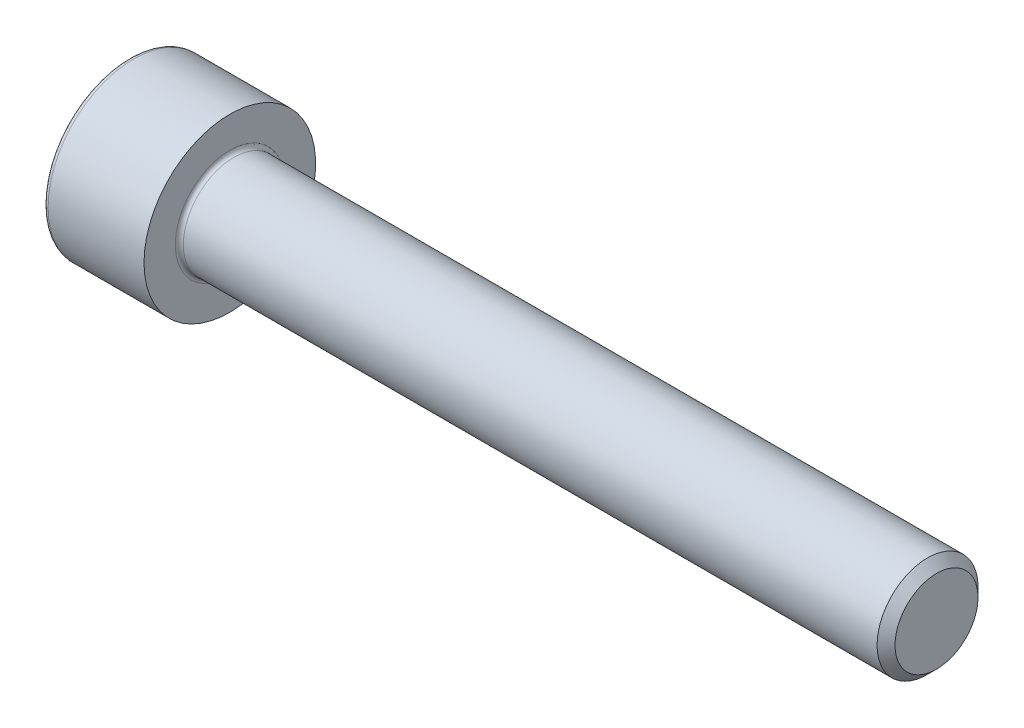
ISO-10303-21;
HEADER;
FILE_DESCRIPTION(('STEP AP214'),'2;1');
FILE_NAME('part.step','',(''),(''),'','','');
FILE_SCHEMA(('AUTOMOTIVE_DESIGN { 1 0 10303 214 1 1 1 1 }'));
ENDSEC;
DATA;
#1=APPLICATION_CONTEXT('core data for automotive mechanical design processes');
#2=APPLICATION_PROTOCOL_DEFINITION('international standard','automotive_design',2000,#1);
#3=PRODUCT_CONTEXT('',#1,'mechanical');
#4=PRODUCT('Part','Part','',(#3));
#5=PRODUCT_RELATED_PRODUCT_CATEGORY('part','',(#4));
#6=PRODUCT_DEFINITION_FORMATION('','',#4);
#7=PRODUCT_DEFINITION_CONTEXT('part definition',#1,'design');
#8=PRODUCT_DEFINITION('design','',#6,#7);
#9=PRODUCT_DEFINITION_SHAPE('','',#8);
#10=(LENGTH_UNIT() NAMED_UNIT(*) SI_UNIT(.MILLI.,.METRE.));
#11=(NAMED_UNIT(*) PLANE_ANGLE_UNIT() SI_UNIT($,.RADIAN.));
#12=(NAMED_UNIT(*) SI_UNIT($,.STERADIAN.) SOLID_ANGLE_UNIT());
#13=UNCERTAINTY_MEASURE_WITH_UNIT(LENGTH_MEASURE(1.E-05),#10,'distance_accuracy_value','');
#14=(GEOMETRIC_REPRESENTATION_CONTEXT(3) GLOBAL_UNCERTAINTY_ASSIGNED_CONTEXT((#13)) GLOBAL_UNIT_ASSIGNED_CONTEXT((#10,
#11,#12)) REPRESENTATION_CONTEXT('',''));
#15=CARTESIAN_POINT('',(0.,0.,0.));
#16=DIRECTION('',(0.,0.,1.));
#17=DIRECTION('',(1.,0.,0.));
#18=AXIS2_PLACEMENT_3D('',#15,#16,#17);
#19=CARTESIAN_POINT('',(0.,0.,0.));
#20=DIRECTION('',(-1.,0.,0.));
#21=DIRECTION('',(0.,0.,1.));
#22=AXIS2_PLACEMENT_3D('',#19,#20,#21);
#23=PLANE('',#22);
#24=DIRECTION('',(0.,-0.5,0.866025403784439));
#25=VECTOR('',#24,1.);
#26=CARTESIAN_POINT('',(0.,2.35789849937043,0.));
#27=LINE('',#26,#25);
#28=CARTESIAN_POINT('',(0.,2.35789849937043,0.));
#29=VERTEX_POINT('',#28);
#30=CARTESIAN_POINT('',(0.,1.17894924968521,2.042));
#31=VERTEX_POINT('',#30);
#32=EDGE_CURVE('E285',#29,#31,#27,.T.);
#33=ORIENTED_EDGE('',*,*,#32,.T.);
#34=DIRECTION('',(0.,1.,0.));
#35=VECTOR('',#34,1.);
#36=CARTESIAN_POINT('',(0.,-1.17894924968522,2.042));
#37=LINE('',#36,#35);
#38=CARTESIAN_POINT('',(0.,-1.17894924968522,2.042));
#39=VERTEX_POINT('',#38);
#40=EDGE_CURVE('E142',#39,#31,#37,.T.);
#41=ORIENTED_EDGE('',*,*,#40,.F.);
#42=DIRECTION('',(0.,-0.500000000000001,-0.866025403784438));
#43=VECTOR('',#42,1.);
#44=CARTESIAN_POINT('',(0.,-1.17894924968522,2.042));
#45=LINE('',#44,#43);
#46=CARTESIAN_POINT('',(0.,-2.35789849937044,0.));
#47=VERTEX_POINT('',#46);
#48=EDGE_CURVE('E290',#39,#47,#45,.T.);
#49=ORIENTED_EDGE('',*,*,#48,.T.);
#50=DIRECTION('',(0.,0.499999999999999,-0.866025403784439));
#51=VECTOR('',#50,1.);
#52=CARTESIAN_POINT('',(0.,-2.35789849937044,0.));
#53=LINE('',#52,#51);
#54=CARTESIAN_POINT('',(0.,-1.17894924968522,-2.042));
#55=VERTEX_POINT('',#54);
#56=EDGE_CURVE('E294',#47,#55,#53,.T.);
#57=ORIENTED_EDGE('',*,*,#56,.T.);
#58=DIRECTION('',(0.,-1.,0.));
#59=VECTOR('',#58,1.);
#60=CARTESIAN_POINT('',(0.,1.17894924968521,-2.042));
#61=LINE('',#60,#59);
#62=CARTESIAN_POINT('',(0.,1.17894924968521,-2.042));
#63=VERTEX_POINT('',#62);
#64=EDGE_CURVE('E298',#63,#55,#61,.T.);
#65=ORIENTED_EDGE('',*,*,#64,.F.);
#66=DIRECTION('',(0.,-0.500000000000001,-0.866025403784438));
#67=VECTOR('',#66,1.);
#68=CARTESIAN_POINT('',(0.,2.35789849937043,0.));
#69=LINE('',#68,#67);
#70=EDGE_CURVE('E137',#29,#63,#69,.T.);
#71=ORIENTED_EDGE('',*,*,#70,.F.);
#72=EDGE_LOOP('',(#33,#41,#49,#57,#65,#71));
#73=FACE_BOUND('',#72,.T.);
#74=CARTESIAN_POINT('',(0.,0.,0.));
#75=DIRECTION('',(-1.,0.,0.));
#76=DIRECTION('',(0.,0.,1.));
#77=AXIS2_PLACEMENT_3D('',#74,#75,#76);
#78=CIRCLE('',#77,4.);
#79=CARTESIAN_POINT('',(0.,0.,4.));
#80=VERTEX_POINT('',#79);
#81=EDGE_CURVE('E52',#80,#80,#78,.T.);
#82=ORIENTED_EDGE('',*,*,#81,.T.);
#83=EDGE_LOOP('',(#82));
#84=FACE_BOUND('',#83,.T.);
#85=ADVANCED_FACE('F43',(#73,#84),#23,.T.);
#86=CARTESIAN_POINT('',(-31.75,0.,0.));
#87=DIRECTION('',(-1.,0.,0.));
#88=DIRECTION('',(0.,0.,1.));
#89=AXIS2_PLACEMENT_3D('',#86,#87,#88);
#90=CYLINDRICAL_SURFACE('',#89,4.25);
#91=CARTESIAN_POINT('',(0.25,0.,0.));
#92=DIRECTION('',(-1.,0.,0.));
#93=DIRECTION('',(0.,0.,1.));
#94=AXIS2_PLACEMENT_3D('',#91,#92,#93);
#95=CIRCLE('',#94,4.25);
#96=CARTESIAN_POINT('',(0.25,0.,4.25));
#97=VERTEX_POINT('',#96);
#98=EDGE_CURVE('E11',#97,#97,#95,.F.);
#99=ORIENTED_EDGE('',*,*,#98,.T.);
#100=EDGE_LOOP('',(#99));
#101=FACE_BOUND('',#100,.T.);
#102=CARTESIAN_POINT('',(5.,0.,0.));
#103=DIRECTION('',(-1.,0.,0.));
#104=DIRECTION('',(0.,0.,1.));
#105=AXIS2_PLACEMENT_3D('',#102,#103,#104);
#106=CIRCLE('',#105,4.25);
#107=CARTESIAN_POINT('',(5.,0.,4.25));
#108=VERTEX_POINT('',#107);
#109=EDGE_CURVE('E166',#108,#108,#106,.T.);
#110=ORIENTED_EDGE('',*,*,#109,.T.);
#111=EDGE_LOOP('',(#110));
#112=FACE_BOUND('',#111,.T.);
#113=ADVANCED_FACE('F194',(#101,#112),#90,.T.);
#114=CARTESIAN_POINT('',(5.,4.25,0.));
#115=DIRECTION('',(1.,0.,0.));
#116=DIRECTION('',(0.,0.,-1.));
#117=AXIS2_PLACEMENT_3D('',#114,#115,#116);
#118=PLANE('',#117);
#119=CARTESIAN_POINT('',(5.,0.,0.));
#120=DIRECTION('',(1.,0.,0.));
#121=DIRECTION('',(0.,0.,-1.));
#122=AXIS2_PLACEMENT_3D('',#119,#120,#121);
#123=CIRCLE('',#122,2.7);
#124=CARTESIAN_POINT('',(5.,0.,-2.7));
#125=VERTEX_POINT('',#124);
#126=EDGE_CURVE('E170',#125,#125,#123,.F.);
#127=ORIENTED_EDGE('',*,*,#126,.T.);
#128=EDGE_LOOP('',(#127));
#129=FACE_BOUND('',#128,.T.);
#130=ORIENTED_EDGE('',*,*,#109,.F.);
#131=EDGE_LOOP('',(#130));
#132=FACE_BOUND('',#131,.T.);
#133=ADVANCED_FACE('F200',(#129,#132),#118,.T.);
#134=CARTESIAN_POINT('',(-31.75,0.,0.));
#135=DIRECTION('',(-1.,0.,0.));
#136=DIRECTION('',(0.,0.,1.));
#137=AXIS2_PLACEMENT_3D('',#134,#135,#136);
#138=CYLINDRICAL_SURFACE('',#137,2.5);
#139=CARTESIAN_POINT('',(5.2,0.,0.));
#140=DIRECTION('',(1.,0.,0.));
#141=DIRECTION('',(0.,0.,-1.));
#142=AXIS2_PLACEMENT_3D('',#139,#140,#141);
#143=CIRCLE('',#142,2.5);
#144=CARTESIAN_POINT('',(5.2,0.,-2.5));
#145=VERTEX_POINT('',#144);
#146=EDGE_CURVE('E174',#145,#145,#143,.T.);
#147=ORIENTED_EDGE('',*,*,#146,.T.);
#148=EDGE_LOOP('',(#147));
#149=FACE_BOUND('',#148,.T.);
#150=CARTESIAN_POINT('',(39.555,0.,0.));
#151=DIRECTION('',(-1.,0.,0.));
#152=DIRECTION('',(0.,0.,1.));
#153=AXIS2_PLACEMENT_3D('',#150,#151,#152);
#154=CIRCLE('',#153,2.5);
#155=CARTESIAN_POINT('',(39.555,0.,2.5));
#156=VERTEX_POINT('',#155);
#157=EDGE_CURVE('E162',#156,#156,#154,.T.);
#158=ORIENTED_EDGE('',*,*,#157,.T.);
#159=EDGE_LOOP('',(#158));
#160=FACE_BOUND('',#159,.T.);
#161=ADVANCED_FACE('F206',(#149,#160),#138,.T.);
#162=CARTESIAN_POINT('',(40.,0.,0.));
#163=DIRECTION('',(-1.,0.,0.));
#164=DIRECTION('',(0.,0.,1.));
#165=AXIS2_PLACEMENT_3D('',#162,#163,#164);
#166=CONICAL_SURFACE('',#165,2.055,0.785398163397462);
#167=ORIENTED_EDGE('',*,*,#157,.F.);
#168=EDGE_LOOP('',(#167));
#169=FACE_BOUND('',#168,.T.);
#170=CARTESIAN_POINT('',(40.,0.,0.));
#171=DIRECTION('',(-1.,0.,0.));
#172=DIRECTION('',(0.,0.,1.));
#173=AXIS2_PLACEMENT_3D('',#170,#171,#172);
#174=CIRCLE('',#173,2.055);
#175=CARTESIAN_POINT('',(40.,0.,2.055));
#176=VERTEX_POINT('',#175);
#177=EDGE_CURVE('E157',#176,#176,#174,.T.);
#178=ORIENTED_EDGE('',*,*,#177,.T.);
#179=EDGE_LOOP('',(#178));
#180=FACE_BOUND('',#179,.T.);
#181=ADVANCED_FACE('F210',(#169,#180),#166,.T.);
#182=CARTESIAN_POINT('',(40.,2.055,0.));
#183=DIRECTION('',(1.,0.,0.));
#184=DIRECTION('',(0.,0.,-1.));
#185=AXIS2_PLACEMENT_3D('',#182,#183,#184);
#186=PLANE('',#185);
#187=ORIENTED_EDGE('',*,*,#177,.F.);
#188=EDGE_LOOP('',(#187));
#189=FACE_BOUND('',#188,.T.);
#190=ADVANCED_FACE('F190',(#189),#186,.T.);
#191=CARTESIAN_POINT('',(5.2,0.,0.));
#192=DIRECTION('',(1.,0.,0.));
#193=DIRECTION('',(0.,0.,-1.));
#194=AXIS2_PLACEMENT_3D('',#191,#192,#193);
#195=TOROIDAL_SURFACE('',#194,2.7,0.2);
#196=ORIENTED_EDGE('',*,*,#146,.F.);
#197=EDGE_LOOP('',(#196));
#198=FACE_BOUND('',#197,.T.);
#199=ORIENTED_EDGE('',*,*,#126,.F.);
#200=EDGE_LOOP('',(#199));
#201=FACE_BOUND('',#200,.T.);
#202=ADVANCED_FACE('F183',(#198,#201),#195,.F.);
#203=CARTESIAN_POINT('',(0.25,0.,0.));
#204=DIRECTION('',(-1.,0.,0.));
#205=DIRECTION('',(0.,0.,1.));
#206=AXIS2_PLACEMENT_3D('',#203,#204,#205);
#207=TOROIDAL_SURFACE('',#206,4.,0.25);
#208=ORIENTED_EDGE('',*,*,#98,.F.);
#209=EDGE_LOOP('',(#208));
#210=FACE_BOUND('',#209,.T.);
#211=ORIENTED_EDGE('',*,*,#81,.F.);
#212=EDGE_LOOP('',(#211));
#213=FACE_BOUND('',#212,.T.);
#214=ADVANCED_FACE('F45',(#210,#213),#207,.T.);
#215=CARTESIAN_POINT('',(2.5,2.35789849937043,0.));
#216=DIRECTION('',(0.,-0.866025403784439,-0.5));
#217=DIRECTION('',(0.,0.5,-0.866025403784439));
#218=AXIS2_PLACEMENT_3D('',#215,#216,#217);
#219=PLANE('',#218);
#220=ORIENTED_EDGE('',*,*,#32,.F.);
#221=DIRECTION('',(-1.,0.,0.));
#222=VECTOR('',#221,1.);
#223=CARTESIAN_POINT('',(2.5,2.35789849937043,0.));
#224=LINE('',#223,#222);
#225=CARTESIAN_POINT('',(2.5,2.35789849937043,0.));
#226=VERTEX_POINT('',#225);
#227=EDGE_CURVE('E272',#226,#29,#224,.T.);
#228=ORIENTED_EDGE('',*,*,#227,.F.);
#229=DIRECTION('',(0.,-0.5,0.866025403784439));
#230=VECTOR('',#229,1.);
#231=CARTESIAN_POINT('',(2.5,2.35789849937043,0.));
#232=LINE('',#231,#230);
#233=CARTESIAN_POINT('',(2.5,1.76842387452782,1.021));
#234=VERTEX_POINT('',#233);
#235=EDGE_CURVE('E128',#226,#234,#232,.T.);
#236=ORIENTED_EDGE('',*,*,#235,.T.);
#237=CARTESIAN_POINT('',(2.5,1.17894924968521,2.042));
#238=VERTEX_POINT('',#237);
#239=EDGE_CURVE('E118',#234,#238,#232,.T.);
#240=ORIENTED_EDGE('',*,*,#239,.T.);
#241=DIRECTION('',(-1.,0.,0.));
#242=VECTOR('',#241,1.);
#243=CARTESIAN_POINT('',(2.5,1.17894924968521,2.042));
#244=LINE('',#243,#242);
#245=EDGE_CURVE('E133',#238,#31,#244,.T.);
#246=ORIENTED_EDGE('',*,*,#245,.T.);
#247=EDGE_LOOP('',(#220,#228,#236,#240,#246));
#248=FACE_BOUND('',#247,.T.);
#249=ADVANCED_FACE('F132',(#248),#219,.T.);
#250=CARTESIAN_POINT('',(2.5,-1.17894924968522,2.042));
#251=DIRECTION('',(0.,0.,1.));
#252=DIRECTION('',(0.,-1.,0.));
#253=AXIS2_PLACEMENT_3D('',#250,#251,#252);
#254=PLANE('',#253);
#255=ORIENTED_EDGE('',*,*,#40,.T.);
#256=ORIENTED_EDGE('',*,*,#245,.F.);
#257=DIRECTION('',(0.,1.,0.));
#258=VECTOR('',#257,1.);
#259=CARTESIAN_POINT('',(2.5,-1.17894924968522,2.042));
#260=LINE('',#259,#258);
#261=CARTESIAN_POINT('',(2.5,0.,2.042));
#262=VERTEX_POINT('',#261);
#263=EDGE_CURVE('E115',#262,#238,#260,.T.);
#264=ORIENTED_EDGE('',*,*,#263,.F.);
#265=CARTESIAN_POINT('',(2.5,-1.17894924968522,2.042));
#266=VERTEX_POINT('',#265);
#267=EDGE_CURVE('E127',#266,#262,#260,.T.);
#268=ORIENTED_EDGE('',*,*,#267,.F.);
#269=DIRECTION('',(-1.,0.,0.));
#270=VECTOR('',#269,1.);
#271=CARTESIAN_POINT('',(2.5,-1.17894924968522,2.042));
#272=LINE('',#271,#270);
#273=EDGE_CURVE('E145',#266,#39,#272,.T.);
#274=ORIENTED_EDGE('',*,*,#273,.T.);
#275=EDGE_LOOP('',(#255,#256,#264,#268,#274));
#276=FACE_BOUND('',#275,.T.);
#277=ADVANCED_FACE('F139',(#276),#254,.F.);
#278=CARTESIAN_POINT('',(2.5,-1.17894924968522,2.042));
#279=DIRECTION('',(0.,0.866025403784438,-0.500000000000001));
#280=DIRECTION('',(0.,0.500000000000001,0.866025403784438));
#281=AXIS2_PLACEMENT_3D('',#278,#279,#280);
#282=PLANE('',#281);
#283=ORIENTED_EDGE('',*,*,#48,.F.);
#284=ORIENTED_EDGE('',*,*,#273,.F.);
#285=DIRECTION('',(0.,-0.500000000000001,-0.866025403784438));
#286=VECTOR('',#285,1.);
#287=CARTESIAN_POINT('',(2.5,-1.17894924968522,2.042));
#288=LINE('',#287,#286);
#289=CARTESIAN_POINT('',(2.5,-1.76842387452783,1.02100000000001));
#290=VERTEX_POINT('',#289);
#291=EDGE_CURVE('E328',#266,#290,#288,.T.);
#292=ORIENTED_EDGE('',*,*,#291,.T.);
#293=CARTESIAN_POINT('',(2.5,-2.35789849937044,0.));
#294=VERTEX_POINT('',#293);
#295=EDGE_CURVE('E312',#290,#294,#288,.T.);
#296=ORIENTED_EDGE('',*,*,#295,.T.);
#297=DIRECTION('',(-1.,0.,0.));
#298=VECTOR('',#297,1.);
#299=CARTESIAN_POINT('',(2.5,-2.35789849937044,0.));
#300=LINE('',#299,#298);
#301=EDGE_CURVE('E152',#294,#47,#300,.T.);
#302=ORIENTED_EDGE('',*,*,#301,.T.);
#303=EDGE_LOOP('',(#283,#284,#292,#296,#302));
#304=FACE_BOUND('',#303,.T.);
#305=ADVANCED_FACE('F224',(#304),#282,.T.);
#306=CARTESIAN_POINT('',(2.5,-2.35789849937044,0.));
#307=DIRECTION('',(0.,0.866025403784439,0.5));
#308=DIRECTION('',(0.,-0.5,0.866025403784439));
#309=AXIS2_PLACEMENT_3D('',#306,#307,#308);
#310=PLANE('',#309);
#311=ORIENTED_EDGE('',*,*,#56,.F.);
#312=ORIENTED_EDGE('',*,*,#301,.F.);
#313=DIRECTION('',(0.,0.499999999999999,-0.866025403784439));
#314=VECTOR('',#313,1.);
#315=CARTESIAN_POINT('',(2.5,-2.35789849937044,0.));
#316=LINE('',#315,#314);
#317=CARTESIAN_POINT('',(2.5,-1.76842387452783,-1.021));
#318=VERTEX_POINT('',#317);
#319=EDGE_CURVE('E280',#294,#318,#316,.T.);
#320=ORIENTED_EDGE('',*,*,#319,.T.);
#321=CARTESIAN_POINT('',(2.5,-1.17894924968522,-2.042));
#322=VERTEX_POINT('',#321);
#323=EDGE_CURVE('E326',#318,#322,#316,.T.);
#324=ORIENTED_EDGE('',*,*,#323,.T.);
#325=DIRECTION('',(-1.,0.,0.));
#326=VECTOR('',#325,1.);
#327=CARTESIAN_POINT('',(2.5,-1.17894924968522,-2.042));
#328=LINE('',#327,#326);
#329=EDGE_CURVE('E271',#322,#55,#328,.T.);
#330=ORIENTED_EDGE('',*,*,#329,.T.);
#331=EDGE_LOOP('',(#311,#312,#320,#324,#330));
#332=FACE_BOUND('',#331,.T.);
#333=ADVANCED_FACE('F227',(#332),#310,.T.);
#334=CARTESIAN_POINT('',(2.5,1.17894924968521,-2.042));
#335=DIRECTION('',(0.,0.,-1.));
#336=DIRECTION('',(0.,1.,0.));
#337=AXIS2_PLACEMENT_3D('',#334,#335,#336);
#338=PLANE('',#337);
#339=ORIENTED_EDGE('',*,*,#64,.T.);
#340=ORIENTED_EDGE('',*,*,#329,.F.);
#341=DIRECTION('',(0.,-1.,0.));
#342=VECTOR('',#341,1.);
#343=CARTESIAN_POINT('',(2.5,1.17894924968521,-2.042));
#344=LINE('',#343,#342);
#345=CARTESIAN_POINT('',(2.5,0.,-2.042));
#346=VERTEX_POINT('',#345);
#347=EDGE_CURVE('E275',#346,#322,#344,.T.);
#348=ORIENTED_EDGE('',*,*,#347,.F.);
#349=CARTESIAN_POINT('',(2.5,1.17894924968521,-2.042));
#350=VERTEX_POINT('',#349);
#351=EDGE_CURVE('E59',#350,#346,#344,.T.);
#352=ORIENTED_EDGE('',*,*,#351,.F.);
#353=DIRECTION('',(-1.,0.,0.));
#354=VECTOR('',#353,1.);
#355=CARTESIAN_POINT('',(2.5,1.17894924968521,-2.042));
#356=LINE('',#355,#354);
#357=EDGE_CURVE('E267',#350,#63,#356,.T.);
#358=ORIENTED_EDGE('',*,*,#357,.T.);
#359=EDGE_LOOP('',(#339,#340,#348,#352,#358));
#360=FACE_BOUND('',#359,.T.);
#361=ADVANCED_FACE('F231',(#360),#338,.F.);
#362=CARTESIAN_POINT('',(2.5,2.35789849937043,0.));
#363=DIRECTION('',(0.,0.866025403784438,-0.500000000000001));
#364=DIRECTION('',(0.,0.500000000000001,0.866025403784438));
#365=AXIS2_PLACEMENT_3D('',#362,#363,#364);
#366=PLANE('',#365);
#367=ORIENTED_EDGE('',*,*,#70,.T.);
#368=ORIENTED_EDGE('',*,*,#357,.F.);
#369=DIRECTION('',(0.,-0.500000000000001,-0.866025403784438));
#370=VECTOR('',#369,1.);
#371=CARTESIAN_POINT('',(2.5,2.35789849937043,0.));
#372=LINE('',#371,#370);
#373=CARTESIAN_POINT('',(2.5,1.76842387452782,-1.021));
#374=VERTEX_POINT('',#373);
#375=EDGE_CURVE('E256',#374,#350,#372,.T.);
#376=ORIENTED_EDGE('',*,*,#375,.F.);
#377=EDGE_CURVE('E263',#226,#374,#372,.T.);
#378=ORIENTED_EDGE('',*,*,#377,.F.);
#379=ORIENTED_EDGE('',*,*,#227,.T.);
#380=EDGE_LOOP('',(#367,#368,#376,#378,#379));
#381=FACE_BOUND('',#380,.T.);
#382=ADVANCED_FACE('F235',(#381),#366,.F.);
#383=CARTESIAN_POINT('',(2.5,0.,4.084));
#384=DIRECTION('',(1.,0.,0.));
#385=DIRECTION('',(0.,0.,-1.));
#386=AXIS2_PLACEMENT_3D('',#383,#384,#385);
#387=PLANE('',#386);
#388=ORIENTED_EDGE('',*,*,#347,.T.);
#389=ORIENTED_EDGE('',*,*,#323,.F.);
#390=CARTESIAN_POINT('',(2.5,0.,0.));
#391=DIRECTION('',(-1.,0.,0.));
#392=DIRECTION('',(0.,0.,1.));
#393=AXIS2_PLACEMENT_3D('',#390,#391,#392);
#394=CIRCLE('',#393,2.042);
#395=EDGE_CURVE('E320',#346,#318,#394,.T.);
#396=ORIENTED_EDGE('',*,*,#395,.F.);
#397=EDGE_LOOP('',(#388,#389,#396));
#398=FACE_BOUND('',#397,.T.);
#399=ADVANCED_FACE('F239',(#398),#387,.F.);
#400=ORIENTED_EDGE('',*,*,#319,.F.);
#401=ORIENTED_EDGE('',*,*,#295,.F.);
#402=EDGE_CURVE('E150',#318,#290,#394,.T.);
#403=ORIENTED_EDGE('',*,*,#402,.F.);
#404=EDGE_LOOP('',(#400,#401,#403));
#405=FACE_BOUND('',#404,.T.);
#406=ADVANCED_FACE('F242',(#405),#387,.F.);
#407=ORIENTED_EDGE('',*,*,#291,.F.);
#408=ORIENTED_EDGE('',*,*,#267,.T.);
#409=EDGE_CURVE('E144',#290,#262,#394,.T.);
#410=ORIENTED_EDGE('',*,*,#409,.F.);
#411=EDGE_LOOP('',(#407,#408,#410));
#412=FACE_BOUND('',#411,.T.);
#413=ADVANCED_FACE('F247',(#412),#387,.F.);
#414=ORIENTED_EDGE('',*,*,#263,.T.);
#415=ORIENTED_EDGE('',*,*,#239,.F.);
#416=EDGE_CURVE('E121',#262,#234,#394,.T.);
#417=ORIENTED_EDGE('',*,*,#416,.F.);
#418=EDGE_LOOP('',(#414,#415,#417));
#419=FACE_BOUND('',#418,.T.);
#420=ADVANCED_FACE('F117',(#419),#387,.F.);
#421=ORIENTED_EDGE('',*,*,#235,.F.);
#422=ORIENTED_EDGE('',*,*,#377,.T.);
#423=EDGE_CURVE('E158',#234,#374,#394,.T.);
#424=ORIENTED_EDGE('',*,*,#423,.F.);
#425=EDGE_LOOP('',(#421,#422,#424));
#426=FACE_BOUND('',#425,.T.);
#427=ADVANCED_FACE('F250',(#426),#387,.F.);
#428=ORIENTED_EDGE('',*,*,#375,.T.);
#429=ORIENTED_EDGE('',*,*,#351,.T.);
#430=EDGE_CURVE('E259',#374,#346,#394,.T.);
#431=ORIENTED_EDGE('',*,*,#430,.F.);
#432=EDGE_LOOP('',(#428,#429,#431));
#433=FACE_BOUND('',#432,.T.);
#434=ADVANCED_FACE('F220',(#433),#387,.F.);
#435=CARTESIAN_POINT('',(2.5,0.,0.));
#436=DIRECTION('',(-1.,0.,0.));
#437=DIRECTION('',(0.,0.,1.));
#438=AXIS2_PLACEMENT_3D('',#435,#436,#437);
#439=CONICAL_SURFACE('',#438,2.042,1.04719755119659);
#440=CARTESIAN_POINT('',(3.67894924968523,0.,0.));
#441=VERTEX_POINT('',#440);
#442=VERTEX_LOOP('',#441);
#443=FACE_BOUND('',#442,.T.);
#444=ORIENTED_EDGE('',*,*,#416,.T.);
#445=ORIENTED_EDGE('',*,*,#423,.T.);
#446=ORIENTED_EDGE('',*,*,#430,.T.);
#447=ORIENTED_EDGE('',*,*,#395,.T.);
#448=ORIENTED_EDGE('',*,*,#402,.T.);
#449=ORIENTED_EDGE('',*,*,#409,.T.);
#450=EDGE_LOOP('',(#444,#445,#446,#447,#448,#449));
#451=FACE_BOUND('',#450,.T.);
#452=ADVANCED_FACE('F218',(#443,#451),#439,.F.);
#453=CLOSED_SHELL('',(#85,#113,#133,#161,#181,#190,#202,#214,#249,#277,#305,#333,#361,#382,#399,
#406,#413,#420,#427,#434,#452));
#454=MANIFOLD_SOLID_BREP('B2',#453);
#455=ADVANCED_BREP_SHAPE_REPRESENTATION('',(#18,#454),#14);
#456=SHAPE_DEFINITION_REPRESENTATION(#9,#455);
ENDSEC;
END-ISO-10303-21;
